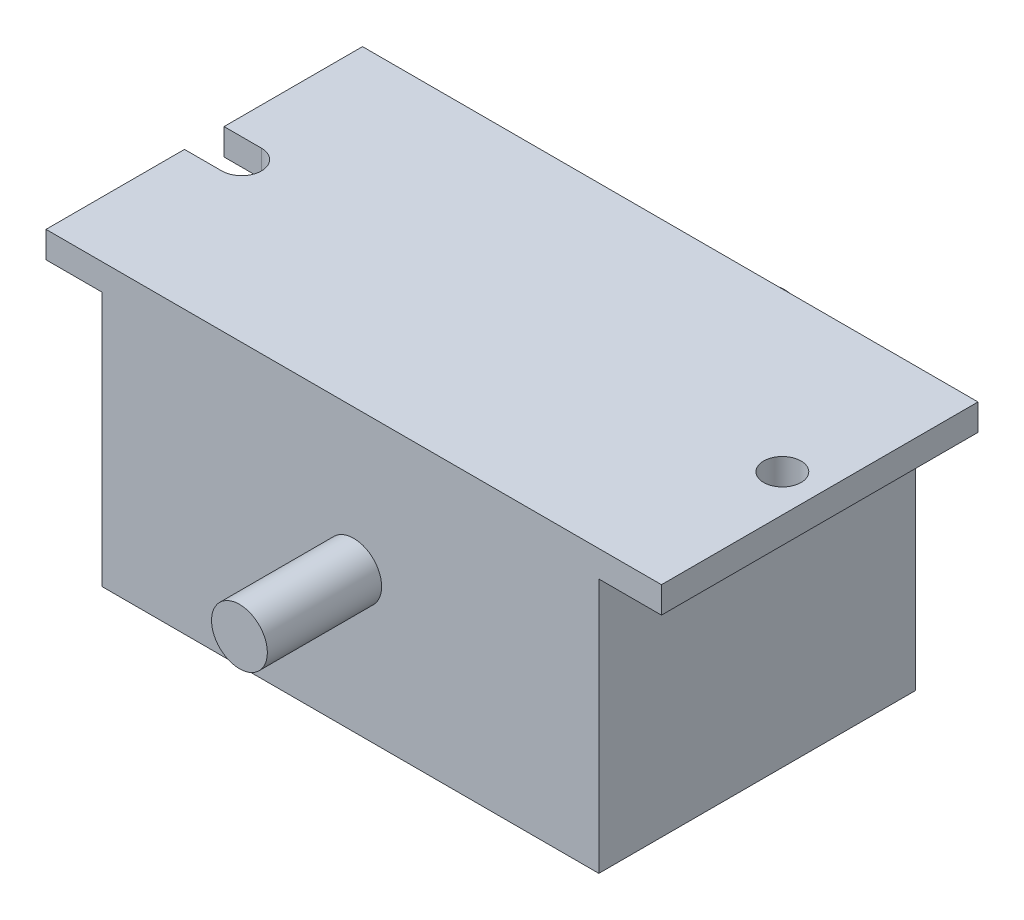
ISO-10303-21;
HEADER;
FILE_DESCRIPTION(('STEP AP214'),'2;1');
FILE_NAME('part.step','',(''),(''),'','','');
FILE_SCHEMA(('AUTOMOTIVE_DESIGN { 1 0 10303 214 1 1 1 1 }'));
ENDSEC;
DATA;
#1=APPLICATION_CONTEXT('core data for automotive mechanical design processes');
#2=APPLICATION_PROTOCOL_DEFINITION('international standard','automotive_design',2000,#1);
#3=PRODUCT_CONTEXT('',#1,'mechanical');
#4=PRODUCT('Part','Part','',(#3));
#5=PRODUCT_RELATED_PRODUCT_CATEGORY('part','',(#4));
#6=PRODUCT_DEFINITION_FORMATION('','',#4);
#7=PRODUCT_DEFINITION_CONTEXT('part definition',#1,'design');
#8=PRODUCT_DEFINITION('design','',#6,#7);
#9=PRODUCT_DEFINITION_SHAPE('','',#8);
#10=(LENGTH_UNIT() NAMED_UNIT(*) SI_UNIT(.MILLI.,.METRE.));
#11=(NAMED_UNIT(*) PLANE_ANGLE_UNIT() SI_UNIT($,.RADIAN.));
#12=(NAMED_UNIT(*) SI_UNIT($,.STERADIAN.) SOLID_ANGLE_UNIT());
#13=UNCERTAINTY_MEASURE_WITH_UNIT(LENGTH_MEASURE(1.E-05),#10,'distance_accuracy_value','');
#14=(GEOMETRIC_REPRESENTATION_CONTEXT(3) GLOBAL_UNCERTAINTY_ASSIGNED_CONTEXT((#13)) GLOBAL_UNIT_ASSIGNED_CONTEXT((#10,
#11,#12)) REPRESENTATION_CONTEXT('',''));
#15=CARTESIAN_POINT('',(0.,0.,0.));
#16=DIRECTION('',(0.,0.,1.));
#17=DIRECTION('',(1.,0.,0.));
#18=AXIS2_PLACEMENT_3D('',#15,#16,#17);
#19=CARTESIAN_POINT('',(-70.,32.210989010989,72.));
#20=DIRECTION('',(1.,0.,0.));
#21=DIRECTION('',(0.,1.,0.));
#22=AXIS2_PLACEMENT_3D('',#19,#20,#21);
#23=PLANE('',#22);
#24=DIRECTION('',(0.,0.,-1.));
#25=VECTOR('',#24,1.);
#26=CARTESIAN_POINT('',(-70.,32.210989010989,72.));
#27=LINE('',#26,#25);
#28=CARTESIAN_POINT('',(-70.,32.210989010989,72.));
#29=VERTEX_POINT('',#28);
#30=CARTESIAN_POINT('',(-70.,32.2109890109889,40.5));
#31=VERTEX_POINT('',#30);
#32=EDGE_CURVE('E188',#29,#31,#27,.T.);
#33=ORIENTED_EDGE('',*,*,#32,.T.);
#34=DIRECTION('',(0.,1.,0.));
#35=VECTOR('',#34,1.);
#36=CARTESIAN_POINT('',(-69.9999999999998,-31.7890109890112,40.5));
#37=LINE('',#36,#35);
#38=CARTESIAN_POINT('',(-70.,26.210989010989,40.5));
#39=VERTEX_POINT('',#38);
#40=EDGE_CURVE('E215',#39,#31,#37,.T.);
#41=ORIENTED_EDGE('',*,*,#40,.F.);
#42=DIRECTION('',(0.,0.,-1.));
#43=VECTOR('',#42,1.);
#44=CARTESIAN_POINT('',(-70.,26.210989010989,72.));
#45=LINE('',#44,#43);
#46=CARTESIAN_POINT('',(-70.,26.210989010989,72.));
#47=VERTEX_POINT('',#46);
#48=EDGE_CURVE('E185',#47,#39,#45,.T.);
#49=ORIENTED_EDGE('',*,*,#48,.F.);
#50=DIRECTION('',(0.,-1.,0.));
#51=VECTOR('',#50,1.);
#52=CARTESIAN_POINT('',(-70.,32.210989010989,72.));
#53=LINE('',#52,#51);
#54=EDGE_CURVE('E133',#29,#47,#53,.T.);
#55=ORIENTED_EDGE('',*,*,#54,.F.);
#56=EDGE_LOOP('',(#33,#41,#49,#55));
#57=FACE_BOUND('',#56,.T.);
#58=ADVANCED_FACE('F46',(#57),#23,.F.);
#59=CARTESIAN_POINT('',(-70.,26.210989010989,72.));
#60=DIRECTION('',(0.,1.,0.));
#61=DIRECTION('',(0.,0.,1.));
#62=AXIS2_PLACEMENT_3D('',#59,#60,#61);
#63=PLANE('',#62);
#64=DIRECTION('',(1.,0.,0.));
#65=VECTOR('',#64,1.);
#66=CARTESIAN_POINT('',(-70.,26.210989010989,40.5));
#67=LINE('',#66,#65);
#68=CARTESIAN_POINT('',(-61.4999999999999,26.2109890109888,40.5));
#69=VERTEX_POINT('',#68);
#70=EDGE_CURVE('E54',#39,#69,#67,.T.);
#71=ORIENTED_EDGE('',*,*,#70,.T.);
#72=CARTESIAN_POINT('',(-61.4999999999999,26.2109890109888,36.));
#73=DIRECTION('',(0.,1.,0.));
#74=DIRECTION('',(0.,0.,1.));
#75=AXIS2_PLACEMENT_3D('',#72,#73,#74);
#76=CIRCLE('',#75,4.5);
#77=CARTESIAN_POINT('',(-57.25,26.210989010989,37.4790199457751));
#78=VERTEX_POINT('',#77);
#79=EDGE_CURVE('E145',#69,#78,#76,.T.);
#80=ORIENTED_EDGE('',*,*,#79,.T.);
#81=DIRECTION('',(0.,0.,-1.));
#82=VECTOR('',#81,1.);
#83=CARTESIAN_POINT('',(-57.25,26.210989010989,72.));
#84=LINE('',#83,#82);
#85=CARTESIAN_POINT('',(-57.25,26.210989010989,72.));
#86=VERTEX_POINT('',#85);
#87=EDGE_CURVE('E140',#86,#78,#84,.T.);
#88=ORIENTED_EDGE('',*,*,#87,.F.);
#89=DIRECTION('',(1.,0.,0.));
#90=VECTOR('',#89,1.);
#91=CARTESIAN_POINT('',(-70.,26.210989010989,72.));
#92=LINE('',#91,#90);
#93=EDGE_CURVE('E126',#47,#86,#92,.T.);
#94=ORIENTED_EDGE('',*,*,#93,.F.);
#95=ORIENTED_EDGE('',*,*,#48,.T.);
#96=EDGE_LOOP('',(#71,#80,#88,#94,#95));
#97=FACE_BOUND('',#96,.T.);
#98=ADVANCED_FACE('F142',(#97),#63,.F.);
#99=CARTESIAN_POINT('',(-57.25,26.210989010989,72.));
#100=DIRECTION('',(1.,0.,0.));
#101=DIRECTION('',(0.,1.,0.));
#102=AXIS2_PLACEMENT_3D('',#99,#100,#101);
#103=PLANE('',#102);
#104=DIRECTION('',(0.,0.,-1.));
#105=VECTOR('',#104,1.);
#106=CARTESIAN_POINT('',(-57.25,-31.789010989011,72.));
#107=LINE('',#106,#105);
#108=CARTESIAN_POINT('',(-57.25,-31.789010989011,34.5209800542249));
#109=VERTEX_POINT('',#108);
#110=CARTESIAN_POINT('',(-57.25,-31.789010989011,0.));
#111=VERTEX_POINT('',#110);
#112=EDGE_CURVE('E183',#109,#111,#107,.T.);
#113=ORIENTED_EDGE('',*,*,#112,.F.);
#114=DIRECTION('',(0.,1.,0.));
#115=VECTOR('',#114,1.);
#116=CARTESIAN_POINT('',(-57.25,-31.7890109890111,34.5209800542249));
#117=LINE('',#116,#115);
#118=CARTESIAN_POINT('',(-57.25,26.210989010989,34.5209800542249));
#119=VERTEX_POINT('',#118);
#120=EDGE_CURVE('E61',#109,#119,#117,.T.);
#121=ORIENTED_EDGE('',*,*,#120,.T.);
#122=CARTESIAN_POINT('',(-57.25,26.210989010989,0.));
#123=VERTEX_POINT('',#122);
#124=EDGE_CURVE('E149',#119,#123,#84,.T.);
#125=ORIENTED_EDGE('',*,*,#124,.T.);
#126=DIRECTION('',(0.,-1.,0.));
#127=VECTOR('',#126,1.);
#128=CARTESIAN_POINT('',(-57.25,26.210989010989,0.));
#129=LINE('',#128,#127);
#130=EDGE_CURVE('E177',#123,#111,#129,.T.);
#131=ORIENTED_EDGE('',*,*,#130,.T.);
#132=EDGE_LOOP('',(#113,#121,#125,#131));
#133=FACE_BOUND('',#132,.T.);
#134=ADVANCED_FACE('F319',(#133),#103,.F.);
#135=CARTESIAN_POINT('',(55.75,26.210989010989,72.));
#136=DIRECTION('',(-1.,0.,0.));
#137=DIRECTION('',(0.,-1.,0.));
#138=AXIS2_PLACEMENT_3D('',#135,#136,#137);
#139=PLANE('',#138);
#140=DIRECTION('',(0.,1.,0.));
#141=VECTOR('',#140,1.);
#142=CARTESIAN_POINT('',(55.75,26.210989010989,0.));
#143=LINE('',#142,#141);
#144=CARTESIAN_POINT('',(55.75,-31.789010989011,0.));
#145=VERTEX_POINT('',#144);
#146=CARTESIAN_POINT('',(55.75,26.210989010989,0.));
#147=VERTEX_POINT('',#146);
#148=EDGE_CURVE('E159',#145,#147,#143,.T.);
#149=ORIENTED_EDGE('',*,*,#148,.T.);
#150=DIRECTION('',(0.,0.,-1.));
#151=VECTOR('',#150,1.);
#152=CARTESIAN_POINT('',(55.75,26.210989010989,72.));
#153=LINE('',#152,#151);
#154=CARTESIAN_POINT('',(55.75,26.210989010989,72.));
#155=VERTEX_POINT('',#154);
#156=EDGE_CURVE('E197',#155,#147,#153,.T.);
#157=ORIENTED_EDGE('',*,*,#156,.F.);
#158=DIRECTION('',(0.,1.,0.));
#159=VECTOR('',#158,1.);
#160=CARTESIAN_POINT('',(55.75,26.210989010989,72.));
#161=LINE('',#160,#159);
#162=CARTESIAN_POINT('',(55.7500000000001,-31.789010989011,72.));
#163=VERTEX_POINT('',#162);
#164=EDGE_CURVE('E181',#163,#155,#161,.T.);
#165=ORIENTED_EDGE('',*,*,#164,.F.);
#166=DIRECTION('',(0.,0.,-1.));
#167=VECTOR('',#166,1.);
#168=CARTESIAN_POINT('',(55.7500000000001,-31.789010989011,72.));
#169=LINE('',#168,#167);
#170=EDGE_CURVE('E155',#163,#145,#169,.T.);
#171=ORIENTED_EDGE('',*,*,#170,.T.);
#172=EDGE_LOOP('',(#149,#157,#165,#171));
#173=FACE_BOUND('',#172,.T.);
#174=ADVANCED_FACE('F48',(#173),#139,.F.);
#175=CARTESIAN_POINT('',(70.0000000000001,26.2109890109888,72.));
#176=DIRECTION('',(0.,1.,0.));
#177=DIRECTION('',(-1.,0.,0.));
#178=AXIS2_PLACEMENT_3D('',#175,#176,#177);
#179=PLANE('',#178);
#180=CARTESIAN_POINT('',(61.5,26.2109890109889,36.));
#181=DIRECTION('',(0.,1.,0.));
#182=DIRECTION('',(-1.,0.,0.));
#183=AXIS2_PLACEMENT_3D('',#180,#181,#182);
#184=CIRCLE('',#183,4.25000000000001);
#185=CARTESIAN_POINT('',(57.25,26.2109890109889,36.));
#186=VERTEX_POINT('',#185);
#187=EDGE_CURVE('E163',#186,#186,#184,.T.);
#188=ORIENTED_EDGE('',*,*,#187,.T.);
#189=EDGE_LOOP('',(#188));
#190=FACE_BOUND('',#189,.T.);
#191=DIRECTION('',(1.,0.,0.));
#192=VECTOR('',#191,1.);
#193=CARTESIAN_POINT('',(70.0000000000002,26.2109890109888,0.));
#194=LINE('',#193,#192);
#195=CARTESIAN_POINT('',(70.0000000000002,26.2109890109888,0.));
#196=VERTEX_POINT('',#195);
#197=EDGE_CURVE('E162',#147,#196,#194,.T.);
#198=ORIENTED_EDGE('',*,*,#197,.T.);
#199=DIRECTION('',(0.,0.,-1.));
#200=VECTOR('',#199,1.);
#201=CARTESIAN_POINT('',(70.0000000000001,26.2109890109888,72.));
#202=LINE('',#201,#200);
#203=CARTESIAN_POINT('',(70.0000000000001,26.2109890109888,72.));
#204=VERTEX_POINT('',#203);
#205=EDGE_CURVE('E194',#204,#196,#202,.T.);
#206=ORIENTED_EDGE('',*,*,#205,.F.);
#207=DIRECTION('',(1.,0.,0.));
#208=VECTOR('',#207,1.);
#209=CARTESIAN_POINT('',(70.0000000000001,26.2109890109888,72.));
#210=LINE('',#209,#208);
#211=EDGE_CURVE('E111',#155,#204,#210,.T.);
#212=ORIENTED_EDGE('',*,*,#211,.F.);
#213=ORIENTED_EDGE('',*,*,#156,.T.);
#214=EDGE_LOOP('',(#198,#206,#212,#213));
#215=FACE_BOUND('',#214,.T.);
#216=ADVANCED_FACE('F326',(#190,#215),#179,.F.);
#217=CARTESIAN_POINT('',(70.0000000000001,32.2109890109889,72.));
#218=DIRECTION('',(-1.,0.,0.));
#219=DIRECTION('',(0.,-1.,0.));
#220=AXIS2_PLACEMENT_3D('',#217,#218,#219);
#221=PLANE('',#220);
#222=DIRECTION('',(0.,1.,0.));
#223=VECTOR('',#222,1.);
#224=CARTESIAN_POINT('',(70.0000000000001,32.2109890109889,0.));
#225=LINE('',#224,#223);
#226=CARTESIAN_POINT('',(70.0000000000001,32.2109890109889,0.));
#227=VERTEX_POINT('',#226);
#228=EDGE_CURVE('E165',#196,#227,#225,.T.);
#229=ORIENTED_EDGE('',*,*,#228,.T.);
#230=DIRECTION('',(0.,0.,-1.));
#231=VECTOR('',#230,1.);
#232=CARTESIAN_POINT('',(70.0000000000001,32.2109890109889,72.));
#233=LINE('',#232,#231);
#234=CARTESIAN_POINT('',(70.0000000000001,32.2109890109889,72.));
#235=VERTEX_POINT('',#234);
#236=EDGE_CURVE('E191',#235,#227,#233,.T.);
#237=ORIENTED_EDGE('',*,*,#236,.F.);
#238=DIRECTION('',(0.,1.,0.));
#239=VECTOR('',#238,1.);
#240=CARTESIAN_POINT('',(70.0000000000001,32.2109890109889,72.));
#241=LINE('',#240,#239);
#242=EDGE_CURVE('E243',#204,#235,#241,.T.);
#243=ORIENTED_EDGE('',*,*,#242,.F.);
#244=ORIENTED_EDGE('',*,*,#205,.T.);
#245=EDGE_LOOP('',(#229,#237,#243,#244));
#246=FACE_BOUND('',#245,.T.);
#247=ADVANCED_FACE('F340',(#246),#221,.F.);
#248=CARTESIAN_POINT('',(-56.4900442477876,32.210989010989,72.));
#249=DIRECTION('',(0.,-1.,0.));
#250=DIRECTION('',(0.,0.,-1.));
#251=AXIS2_PLACEMENT_3D('',#248,#249,#250);
#252=PLANE('',#251);
#253=CARTESIAN_POINT('',(61.5,32.210989010989,36.));
#254=DIRECTION('',(0.,1.,0.));
#255=DIRECTION('',(-1.,0.,0.));
#256=AXIS2_PLACEMENT_3D('',#253,#254,#255);
#257=CIRCLE('',#256,4.25000000000001);
#258=CARTESIAN_POINT('',(57.25,32.210989010989,36.));
#259=VERTEX_POINT('',#258);
#260=EDGE_CURVE('E224',#259,#259,#257,.T.);
#261=ORIENTED_EDGE('',*,*,#260,.F.);
#262=EDGE_LOOP('',(#261));
#263=FACE_BOUND('',#262,.T.);
#264=CARTESIAN_POINT('',(-61.5,32.2109890109889,36.));
#265=DIRECTION('',(0.,1.,0.));
#266=DIRECTION('',(-1.,0.,0.));
#267=AXIS2_PLACEMENT_3D('',#264,#265,#266);
#268=CIRCLE('',#267,4.5);
#269=CARTESIAN_POINT('',(-61.5,32.2109890109889,40.5));
#270=VERTEX_POINT('',#269);
#271=CARTESIAN_POINT('',(-61.5,32.2109890109889,31.5));
#272=VERTEX_POINT('',#271);
#273=EDGE_CURVE('E254',#270,#272,#268,.T.);
#274=ORIENTED_EDGE('',*,*,#273,.F.);
#275=DIRECTION('',(1.,0.,0.));
#276=VECTOR('',#275,1.);
#277=CARTESIAN_POINT('',(-61.5,32.2109890109889,40.5));
#278=LINE('',#277,#276);
#279=EDGE_CURVE('E233',#31,#270,#278,.T.);
#280=ORIENTED_EDGE('',*,*,#279,.F.);
#281=ORIENTED_EDGE('',*,*,#32,.F.);
#282=DIRECTION('',(-1.,0.,0.));
#283=VECTOR('',#282,1.);
#284=CARTESIAN_POINT('',(58.0099557522124,32.210989010989,72.));
#285=LINE('',#284,#283);
#286=EDGE_CURVE('E245',#235,#29,#285,.T.);
#287=ORIENTED_EDGE('',*,*,#286,.F.);
#288=ORIENTED_EDGE('',*,*,#236,.T.);
#289=DIRECTION('',(-1.,0.,0.));
#290=VECTOR('',#289,1.);
#291=CARTESIAN_POINT('',(-56.4900442477876,32.210989010989,0.));
#292=LINE('',#291,#290);
#293=CARTESIAN_POINT('',(-70.,32.210989010989,0.));
#294=VERTEX_POINT('',#293);
#295=EDGE_CURVE('E168',#227,#294,#292,.T.);
#296=ORIENTED_EDGE('',*,*,#295,.T.);
#297=CARTESIAN_POINT('',(-70.,32.2109890109889,31.5));
#298=VERTEX_POINT('',#297);
#299=EDGE_CURVE('E187',#298,#294,#27,.T.);
#300=ORIENTED_EDGE('',*,*,#299,.F.);
#301=DIRECTION('',(-1.,0.,0.));
#302=VECTOR('',#301,1.);
#303=CARTESIAN_POINT('',(-61.5,32.2109890109889,31.5));
#304=LINE('',#303,#302);
#305=EDGE_CURVE('E257',#272,#298,#304,.T.);
#306=ORIENTED_EDGE('',*,*,#305,.F.);
#307=EDGE_LOOP('',(#274,#280,#281,#287,#288,#296,#300,#306));
#308=FACE_BOUND('',#307,.T.);
#309=ADVANCED_FACE('F251',(#263,#308),#252,.F.);
#310=CARTESIAN_POINT('',(-70.,26.210989010989,31.5));
#311=VERTEX_POINT('',#310);
#312=CARTESIAN_POINT('',(-70.,26.210989010989,0.));
#313=VERTEX_POINT('',#312);
#314=EDGE_CURVE('E148',#311,#313,#45,.T.);
#315=ORIENTED_EDGE('',*,*,#314,.F.);
#316=DIRECTION('',(0.,1.,0.));
#317=VECTOR('',#316,1.);
#318=CARTESIAN_POINT('',(-69.9999999999998,-31.7890109890112,31.5));
#319=LINE('',#318,#317);
#320=EDGE_CURVE('E222',#311,#298,#319,.T.);
#321=ORIENTED_EDGE('',*,*,#320,.T.);
#322=ORIENTED_EDGE('',*,*,#299,.T.);
#323=DIRECTION('',(0.,-1.,0.));
#324=VECTOR('',#323,1.);
#325=CARTESIAN_POINT('',(-70.,32.210989010989,0.));
#326=LINE('',#325,#324);
#327=EDGE_CURVE('E171',#294,#313,#326,.T.);
#328=ORIENTED_EDGE('',*,*,#327,.T.);
#329=EDGE_LOOP('',(#315,#321,#322,#328));
#330=FACE_BOUND('',#329,.T.);
#331=ADVANCED_FACE('F315',(#330),#23,.F.);
#332=ORIENTED_EDGE('',*,*,#124,.F.);
#333=CARTESIAN_POINT('',(-61.4999999999999,26.2109890109888,31.5));
#334=VERTEX_POINT('',#333);
#335=EDGE_CURVE('E237',#119,#334,#76,.T.);
#336=ORIENTED_EDGE('',*,*,#335,.T.);
#337=DIRECTION('',(-1.,0.,0.));
#338=VECTOR('',#337,1.);
#339=CARTESIAN_POINT('',(-70.,26.210989010989,31.5));
#340=LINE('',#339,#338);
#341=EDGE_CURVE('E201',#334,#311,#340,.T.);
#342=ORIENTED_EDGE('',*,*,#341,.T.);
#343=ORIENTED_EDGE('',*,*,#314,.T.);
#344=DIRECTION('',(1.,0.,0.));
#345=VECTOR('',#344,1.);
#346=CARTESIAN_POINT('',(-70.,26.210989010989,0.));
#347=LINE('',#346,#345);
#348=EDGE_CURVE('E174',#313,#123,#347,.T.);
#349=ORIENTED_EDGE('',*,*,#348,.T.);
#350=EDGE_LOOP('',(#332,#336,#342,#343,#349));
#351=FACE_BOUND('',#350,.T.);
#352=ADVANCED_FACE('F314',(#351),#63,.F.);
#353=ORIENTED_EDGE('',*,*,#87,.T.);
#354=DIRECTION('',(0.,1.,0.));
#355=VECTOR('',#354,1.);
#356=CARTESIAN_POINT('',(-57.25,-31.7890109890111,37.4790199457751));
#357=LINE('',#356,#355);
#358=CARTESIAN_POINT('',(-57.25,-31.7890109890111,37.4790199457751));
#359=VERTEX_POINT('',#358);
#360=EDGE_CURVE('E234',#78,#359,#357,.F.);
#361=ORIENTED_EDGE('',*,*,#360,.T.);
#362=CARTESIAN_POINT('',(-57.25,-31.789010989011,72.));
#363=VERTEX_POINT('',#362);
#364=EDGE_CURVE('E153',#363,#359,#107,.T.);
#365=ORIENTED_EDGE('',*,*,#364,.F.);
#366=DIRECTION('',(0.,-1.,0.));
#367=VECTOR('',#366,1.);
#368=CARTESIAN_POINT('',(-57.25,26.210989010989,72.));
#369=LINE('',#368,#367);
#370=EDGE_CURVE('E130',#86,#363,#369,.T.);
#371=ORIENTED_EDGE('',*,*,#370,.F.);
#372=EDGE_LOOP('',(#353,#361,#365,#371));
#373=FACE_BOUND('',#372,.T.);
#374=ADVANCED_FACE('F151',(#373),#103,.F.);
#375=CARTESIAN_POINT('',(-57.25,-31.789010989011,72.));
#376=DIRECTION('',(0.,1.,0.));
#377=DIRECTION('',(0.,0.,1.));
#378=AXIS2_PLACEMENT_3D('',#375,#376,#377);
#379=PLANE('',#378);
#380=ORIENTED_EDGE('',*,*,#364,.T.);
#381=CARTESIAN_POINT('',(-61.4999999999999,-31.789010989011,36.0000000000001));
#382=DIRECTION('',(0.,1.,0.));
#383=DIRECTION('',(0.,0.,1.));
#384=AXIS2_PLACEMENT_3D('',#381,#382,#383);
#385=CIRCLE('',#384,4.5);
#386=EDGE_CURVE('E199',#359,#109,#385,.T.);
#387=ORIENTED_EDGE('',*,*,#386,.T.);
#388=ORIENTED_EDGE('',*,*,#112,.T.);
#389=DIRECTION('',(1.,0.,0.));
#390=VECTOR('',#389,1.);
#391=CARTESIAN_POINT('',(-57.25,-31.789010989011,0.));
#392=LINE('',#391,#390);
#393=EDGE_CURVE('E102',#111,#145,#392,.T.);
#394=ORIENTED_EDGE('',*,*,#393,.T.);
#395=ORIENTED_EDGE('',*,*,#170,.F.);
#396=DIRECTION('',(1.,0.,0.));
#397=VECTOR('',#396,1.);
#398=CARTESIAN_POINT('',(-57.25,-31.789010989011,72.));
#399=LINE('',#398,#397);
#400=EDGE_CURVE('E70',#363,#163,#399,.T.);
#401=ORIENTED_EDGE('',*,*,#400,.F.);
#402=EDGE_LOOP('',(#380,#387,#388,#394,#395,#401));
#403=FACE_BOUND('',#402,.T.);
#404=ADVANCED_FACE('F293',(#403),#379,.F.);
#405=CARTESIAN_POINT('',(0.,0.,72.));
#406=DIRECTION('',(0.,0.,1.));
#407=DIRECTION('',(1.,0.,0.));
#408=AXIS2_PLACEMENT_3D('',#405,#406,#407);
#409=PLANE('',#408);
#410=CARTESIAN_POINT('',(0.,0.,72.));
#411=DIRECTION('',(0.,0.,1.));
#412=DIRECTION('',(1.,0.,0.));
#413=AXIS2_PLACEMENT_3D('',#410,#411,#412);
#414=CIRCLE('',#413,6.35);
#415=CARTESIAN_POINT('',(6.35,0.,72.));
#416=VERTEX_POINT('',#415);
#417=EDGE_CURVE('E265',#416,#416,#414,.T.);
#418=ORIENTED_EDGE('',*,*,#417,.F.);
#419=EDGE_LOOP('',(#418));
#420=FACE_BOUND('',#419,.T.);
#421=ORIENTED_EDGE('',*,*,#164,.T.);
#422=ORIENTED_EDGE('',*,*,#211,.T.);
#423=ORIENTED_EDGE('',*,*,#242,.T.);
#424=ORIENTED_EDGE('',*,*,#286,.T.);
#425=ORIENTED_EDGE('',*,*,#54,.T.);
#426=ORIENTED_EDGE('',*,*,#93,.T.);
#427=ORIENTED_EDGE('',*,*,#370,.T.);
#428=ORIENTED_EDGE('',*,*,#400,.T.);
#429=EDGE_LOOP('',(#421,#422,#423,#424,#425,#426,#427,#428));
#430=FACE_BOUND('',#429,.T.);
#431=ADVANCED_FACE('F128',(#420,#430),#409,.T.);
#432=CARTESIAN_POINT('',(0.,0.,0.));
#433=DIRECTION('',(0.,0.,1.));
#434=DIRECTION('',(1.,0.,0.));
#435=AXIS2_PLACEMENT_3D('',#432,#433,#434);
#436=PLANE('',#435);
#437=CARTESIAN_POINT('',(0.,0.,0.));
#438=DIRECTION('',(0.,0.,1.));
#439=DIRECTION('',(1.,0.,0.));
#440=AXIS2_PLACEMENT_3D('',#437,#438,#439);
#441=CIRCLE('',#440,6.35);
#442=CARTESIAN_POINT('',(6.35,0.,0.));
#443=VERTEX_POINT('',#442);
#444=EDGE_CURVE('E13',#443,#443,#441,.F.);
#445=ORIENTED_EDGE('',*,*,#444,.F.);
#446=EDGE_LOOP('',(#445));
#447=FACE_BOUND('',#446,.T.);
#448=ORIENTED_EDGE('',*,*,#148,.F.);
#449=ORIENTED_EDGE('',*,*,#393,.F.);
#450=ORIENTED_EDGE('',*,*,#130,.F.);
#451=ORIENTED_EDGE('',*,*,#348,.F.);
#452=ORIENTED_EDGE('',*,*,#327,.F.);
#453=ORIENTED_EDGE('',*,*,#295,.F.);
#454=ORIENTED_EDGE('',*,*,#228,.F.);
#455=ORIENTED_EDGE('',*,*,#197,.F.);
#456=EDGE_LOOP('',(#448,#449,#450,#451,#452,#453,#454,#455));
#457=FACE_BOUND('',#456,.T.);
#458=ADVANCED_FACE('F283',(#447,#457),#436,.F.);
#459=CARTESIAN_POINT('',(-61.4999999999999,-31.7890109890112,40.5000000000001));
#460=DIRECTION('',(0.,0.,1.));
#461=DIRECTION('',(1.,0.,0.));
#462=AXIS2_PLACEMENT_3D('',#459,#460,#461);
#463=PLANE('',#462);
#464=ORIENTED_EDGE('',*,*,#40,.T.);
#465=ORIENTED_EDGE('',*,*,#279,.T.);
#466=DIRECTION('',(0.,1.,0.));
#467=VECTOR('',#466,1.);
#468=CARTESIAN_POINT('',(-61.4999999999999,-31.7890109890112,40.5000000000001));
#469=LINE('',#468,#467);
#470=EDGE_CURVE('E218',#69,#270,#469,.T.);
#471=ORIENTED_EDGE('',*,*,#470,.F.);
#472=ORIENTED_EDGE('',*,*,#70,.F.);
#473=EDGE_LOOP('',(#464,#465,#471,#472));
#474=FACE_BOUND('',#473,.T.);
#475=ADVANCED_FACE('F212',(#474),#463,.F.);
#476=CARTESIAN_POINT('',(-61.4999999999999,-31.7890109890112,31.5));
#477=DIRECTION('',(0.,0.,-1.));
#478=DIRECTION('',(-1.,0.,0.));
#479=AXIS2_PLACEMENT_3D('',#476,#477,#478);
#480=PLANE('',#479);
#481=DIRECTION('',(0.,1.,0.));
#482=VECTOR('',#481,1.);
#483=CARTESIAN_POINT('',(-61.4999999999999,-31.7890109890112,31.5));
#484=LINE('',#483,#482);
#485=EDGE_CURVE('E227',#334,#272,#484,.T.);
#486=ORIENTED_EDGE('',*,*,#485,.T.);
#487=ORIENTED_EDGE('',*,*,#305,.T.);
#488=ORIENTED_EDGE('',*,*,#320,.F.);
#489=ORIENTED_EDGE('',*,*,#341,.F.);
#490=EDGE_LOOP('',(#486,#487,#488,#489));
#491=FACE_BOUND('',#490,.T.);
#492=ADVANCED_FACE('F306',(#491),#480,.F.);
#493=CARTESIAN_POINT('',(-61.4999999999999,-31.7890109890112,36.0000000000001));
#494=DIRECTION('',(0.,1.,0.));
#495=DIRECTION('',(-1.,0.,0.));
#496=AXIS2_PLACEMENT_3D('',#493,#494,#495);
#497=CYLINDRICAL_SURFACE('',#496,4.5);
#498=ORIENTED_EDGE('',*,*,#120,.F.);
#499=ORIENTED_EDGE('',*,*,#386,.F.);
#500=ORIENTED_EDGE('',*,*,#360,.F.);
#501=ORIENTED_EDGE('',*,*,#79,.F.);
#502=ORIENTED_EDGE('',*,*,#470,.T.);
#503=ORIENTED_EDGE('',*,*,#273,.T.);
#504=ORIENTED_EDGE('',*,*,#485,.F.);
#505=ORIENTED_EDGE('',*,*,#335,.F.);
#506=EDGE_LOOP('',(#498,#499,#500,#501,#502,#503,#504,#505));
#507=FACE_BOUND('',#506,.T.);
#508=ADVANCED_FACE('F356',(#507),#497,.F.);
#509=CARTESIAN_POINT('',(61.5000000000001,-31.789010989011,36.));
#510=DIRECTION('',(0.,1.,0.));
#511=DIRECTION('',(-1.,0.,0.));
#512=AXIS2_PLACEMENT_3D('',#509,#510,#511);
#513=CYLINDRICAL_SURFACE('',#512,4.25000000000001);
#514=ORIENTED_EDGE('',*,*,#260,.T.);
#515=EDGE_LOOP('',(#514));
#516=FACE_BOUND('',#515,.T.);
#517=ORIENTED_EDGE('',*,*,#187,.F.);
#518=EDGE_LOOP('',(#517));
#519=FACE_BOUND('',#518,.T.);
#520=ADVANCED_FACE('F358',(#516,#519),#513,.F.);
#521=CARTESIAN_POINT('',(0.,0.,98.));
#522=DIRECTION('',(0.,0.,-1.));
#523=DIRECTION('',(-1.,0.,0.));
#524=AXIS2_PLACEMENT_3D('',#521,#522,#523);
#525=CYLINDRICAL_SURFACE('',#524,6.35);
#526=CARTESIAN_POINT('',(0.,0.,98.));
#527=DIRECTION('',(0.,0.,1.));
#528=DIRECTION('',(1.,0.,0.));
#529=AXIS2_PLACEMENT_3D('',#526,#527,#528);
#530=CIRCLE('',#529,6.35);
#531=CARTESIAN_POINT('',(6.35,0.,98.));
#532=VERTEX_POINT('',#531);
#533=EDGE_CURVE('E262',#532,#532,#530,.T.);
#534=ORIENTED_EDGE('',*,*,#533,.F.);
#535=EDGE_LOOP('',(#534));
#536=FACE_BOUND('',#535,.T.);
#537=ORIENTED_EDGE('',*,*,#417,.T.);
#538=EDGE_LOOP('',(#537));
#539=FACE_BOUND('',#538,.T.);
#540=ADVANCED_FACE('F364',(#536,#539),#525,.T.);
#541=CARTESIAN_POINT('',(0.,0.,98.));
#542=DIRECTION('',(0.,0.,1.));
#543=DIRECTION('',(1.,0.,0.));
#544=AXIS2_PLACEMENT_3D('',#541,#542,#543);
#545=PLANE('',#544);
#546=ORIENTED_EDGE('',*,*,#533,.T.);
#547=EDGE_LOOP('',(#546));
#548=FACE_BOUND('',#547,.T.);
#549=ADVANCED_FACE('F279',(#548),#545,.T.);
#550=CARTESIAN_POINT('',(0.,0.,-26.));
#551=DIRECTION('',(0.,0.,1.));
#552=DIRECTION('',(1.,0.,0.));
#553=AXIS2_PLACEMENT_3D('',#550,#551,#552);
#554=CYLINDRICAL_SURFACE('',#553,6.35);
#555=CARTESIAN_POINT('',(0.,0.,-26.));
#556=DIRECTION('',(0.,0.,-1.));
#557=DIRECTION('',(-1.,0.,0.));
#558=AXIS2_PLACEMENT_3D('',#555,#556,#557);
#559=CIRCLE('',#558,6.35);
#560=CARTESIAN_POINT('',(-6.35,0.,-26.));
#561=VERTEX_POINT('',#560);
#562=EDGE_CURVE('E268',#561,#561,#559,.T.);
#563=ORIENTED_EDGE('',*,*,#562,.F.);
#564=EDGE_LOOP('',(#563));
#565=FACE_BOUND('',#564,.T.);
#566=ORIENTED_EDGE('',*,*,#444,.T.);
#567=EDGE_LOOP('',(#566));
#568=FACE_BOUND('',#567,.T.);
#569=ADVANCED_FACE('F276',(#565,#568),#554,.T.);
#570=CARTESIAN_POINT('',(0.,0.,-26.));
#571=DIRECTION('',(0.,0.,-1.));
#572=DIRECTION('',(-1.,0.,0.));
#573=AXIS2_PLACEMENT_3D('',#570,#571,#572);
#574=PLANE('',#573);
#575=ORIENTED_EDGE('',*,*,#562,.T.);
#576=EDGE_LOOP('',(#575));
#577=FACE_BOUND('',#576,.T.);
#578=ADVANCED_FACE('F274',(#577),#574,.T.);
#579=CLOSED_SHELL('',(#58,#98,#134,#174,#216,#247,#309,#331,#352,#374,#404,#431,#458,#475,#492,
#508,#520,#540,#549,#569,#578));
#580=MANIFOLD_SOLID_BREP('B2',#579);
#581=ADVANCED_BREP_SHAPE_REPRESENTATION('',(#18,#580),#14);
#582=SHAPE_DEFINITION_REPRESENTATION(#9,#581);
ENDSEC;
END-ISO-10303-21;
